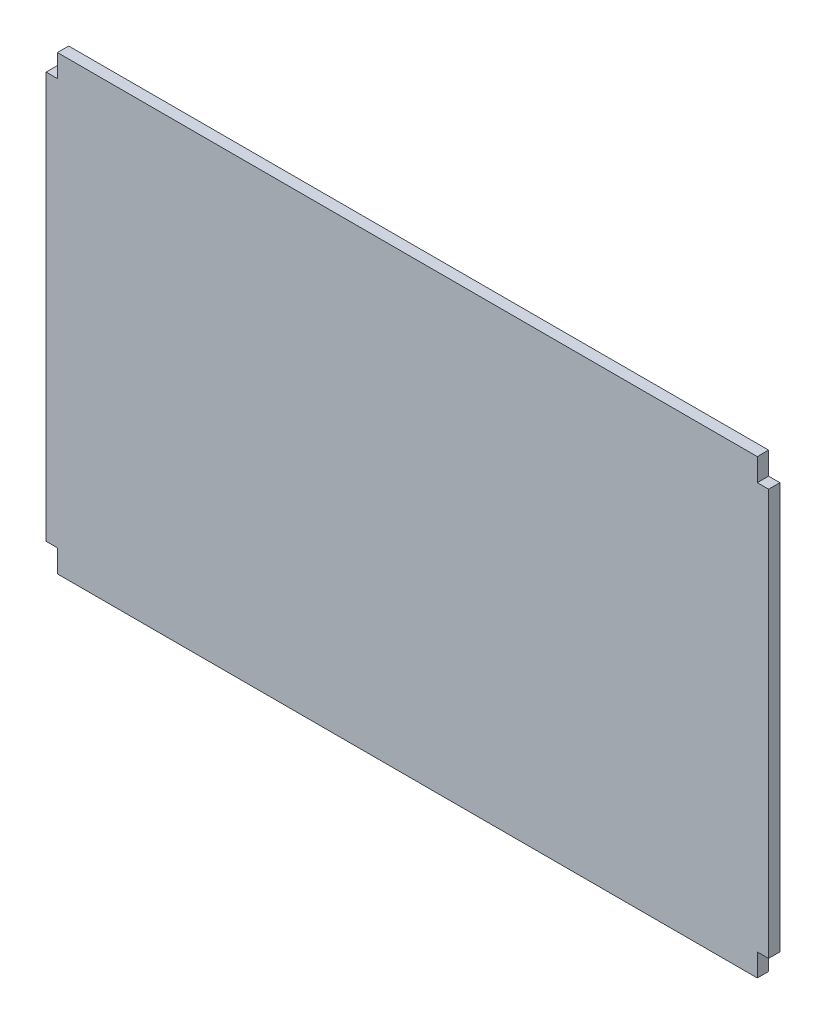
ISO-10303-21;
HEADER;
FILE_DESCRIPTION(('STEP AP214'),'2;1');
FILE_NAME('part.step','',(''),(''),'','','');
FILE_SCHEMA(('AUTOMOTIVE_DESIGN { 1 0 10303 214 1 1 1 1 }'));
ENDSEC;
DATA;
#1=APPLICATION_CONTEXT('core data for automotive mechanical design processes');
#2=APPLICATION_PROTOCOL_DEFINITION('international standard','automotive_design',2000,#1);
#3=PRODUCT_CONTEXT('',#1,'mechanical');
#4=PRODUCT('Part','Part','',(#3));
#5=PRODUCT_RELATED_PRODUCT_CATEGORY('part','',(#4));
#6=PRODUCT_DEFINITION_FORMATION('','',#4);
#7=PRODUCT_DEFINITION_CONTEXT('part definition',#1,'design');
#8=PRODUCT_DEFINITION('design','',#6,#7);
#9=PRODUCT_DEFINITION_SHAPE('','',#8);
#10=(LENGTH_UNIT() NAMED_UNIT(*) SI_UNIT(.MILLI.,.METRE.));
#11=(NAMED_UNIT(*) PLANE_ANGLE_UNIT() SI_UNIT($,.RADIAN.));
#12=(NAMED_UNIT(*) SI_UNIT($,.STERADIAN.) SOLID_ANGLE_UNIT());
#13=UNCERTAINTY_MEASURE_WITH_UNIT(LENGTH_MEASURE(1.E-05),#10,'distance_accuracy_value','');
#14=(GEOMETRIC_REPRESENTATION_CONTEXT(3) GLOBAL_UNCERTAINTY_ASSIGNED_CONTEXT((#13)) GLOBAL_UNIT_ASSIGNED_CONTEXT((#10,
#11,#12)) REPRESENTATION_CONTEXT('',''));
#15=CARTESIAN_POINT('',(0.,0.,0.));
#16=DIRECTION('',(0.,0.,1.));
#17=DIRECTION('',(1.,0.,0.));
#18=AXIS2_PLACEMENT_3D('',#15,#16,#17);
#19=CARTESIAN_POINT('',(0.,0.,3.175));
#20=DIRECTION('',(1.,0.,0.));
#21=DIRECTION('',(0.,0.,-1.));
#22=AXIS2_PLACEMENT_3D('',#19,#20,#21);
#23=PLANE('',#22);
#24=DIRECTION('',(0.,-1.,0.));
#25=VECTOR('',#24,1.);
#26=CARTESIAN_POINT('',(0.,0.,0.));
#27=LINE('',#26,#25);
#28=CARTESIAN_POINT('',(0.,6.35000000000001,0.));
#29=VERTEX_POINT('',#28);
#30=CARTESIAN_POINT('',(0.,0.,0.));
#31=VERTEX_POINT('',#30);
#32=EDGE_CURVE('E154',#29,#31,#27,.T.);
#33=ORIENTED_EDGE('',*,*,#32,.T.);
#34=DIRECTION('',(0.,0.,-1.));
#35=VECTOR('',#34,1.);
#36=CARTESIAN_POINT('',(0.,0.,3.175));
#37=LINE('',#36,#35);
#38=CARTESIAN_POINT('',(0.,0.,3.175));
#39=VERTEX_POINT('',#38);
#40=EDGE_CURVE('E11',#39,#31,#37,.T.);
#41=ORIENTED_EDGE('',*,*,#40,.F.);
#42=DIRECTION('',(0.,-1.,0.));
#43=VECTOR('',#42,1.);
#44=CARTESIAN_POINT('',(0.,0.,3.175));
#45=LINE('',#44,#43);
#46=CARTESIAN_POINT('',(0.,6.35000000000001,3.175));
#47=VERTEX_POINT('',#46);
#48=EDGE_CURVE('E176',#47,#39,#45,.T.);
#49=ORIENTED_EDGE('',*,*,#48,.F.);
#50=DIRECTION('',(0.,0.,-1.));
#51=VECTOR('',#50,1.);
#52=CARTESIAN_POINT('',(0.,6.35000000000001,3.175));
#53=LINE('',#52,#51);
#54=EDGE_CURVE('E150',#47,#29,#53,.T.);
#55=ORIENTED_EDGE('',*,*,#54,.T.);
#56=EDGE_LOOP('',(#33,#41,#49,#55));
#57=FACE_BOUND('',#56,.T.);
#58=ADVANCED_FACE('F34',(#57),#23,.F.);
#59=CARTESIAN_POINT('',(0.,0.,3.175));
#60=DIRECTION('',(0.,1.,0.));
#61=DIRECTION('',(0.,0.,1.));
#62=AXIS2_PLACEMENT_3D('',#59,#60,#61);
#63=PLANE('',#62);
#64=DIRECTION('',(1.,0.,0.));
#65=VECTOR('',#64,1.);
#66=CARTESIAN_POINT('',(0.,0.,0.));
#67=LINE('',#66,#65);
#68=CARTESIAN_POINT('',(196.85,0.,0.));
#69=VERTEX_POINT('',#68);
#70=EDGE_CURVE('E157',#31,#69,#67,.T.);
#71=ORIENTED_EDGE('',*,*,#70,.T.);
#72=DIRECTION('',(0.,0.,-1.));
#73=VECTOR('',#72,1.);
#74=CARTESIAN_POINT('',(196.85,0.,3.175));
#75=LINE('',#74,#73);
#76=CARTESIAN_POINT('',(196.85,0.,3.175));
#77=VERTEX_POINT('',#76);
#78=EDGE_CURVE('E42',#77,#69,#75,.T.);
#79=ORIENTED_EDGE('',*,*,#78,.F.);
#80=DIRECTION('',(1.,0.,0.));
#81=VECTOR('',#80,1.);
#82=CARTESIAN_POINT('',(0.,0.,3.175));
#83=LINE('',#82,#81);
#84=EDGE_CURVE('E105',#39,#77,#83,.T.);
#85=ORIENTED_EDGE('',*,*,#84,.F.);
#86=ORIENTED_EDGE('',*,*,#40,.T.);
#87=EDGE_LOOP('',(#71,#79,#85,#86));
#88=FACE_BOUND('',#87,.T.);
#89=ADVANCED_FACE('F254',(#88),#63,.F.);
#90=CARTESIAN_POINT('',(196.85,0.,3.175));
#91=DIRECTION('',(-1.,0.,0.));
#92=DIRECTION('',(0.,-1.,0.));
#93=AXIS2_PLACEMENT_3D('',#90,#91,#92);
#94=PLANE('',#93);
#95=DIRECTION('',(0.,1.,0.));
#96=VECTOR('',#95,1.);
#97=CARTESIAN_POINT('',(196.85,0.,0.));
#98=LINE('',#97,#96);
#99=CARTESIAN_POINT('',(196.85,6.35000000000001,0.));
#100=VERTEX_POINT('',#99);
#101=EDGE_CURVE('E159',#69,#100,#98,.T.);
#102=ORIENTED_EDGE('',*,*,#101,.T.);
#103=DIRECTION('',(0.,0.,-1.));
#104=VECTOR('',#103,1.);
#105=CARTESIAN_POINT('',(196.85,6.35000000000001,3.175));
#106=LINE('',#105,#104);
#107=CARTESIAN_POINT('',(196.85,6.35000000000001,3.175));
#108=VERTEX_POINT('',#107);
#109=EDGE_CURVE('E195',#108,#100,#106,.T.);
#110=ORIENTED_EDGE('',*,*,#109,.F.);
#111=DIRECTION('',(0.,1.,0.));
#112=VECTOR('',#111,1.);
#113=CARTESIAN_POINT('',(196.85,0.,3.175));
#114=LINE('',#113,#112);
#115=EDGE_CURVE('E203',#77,#108,#114,.T.);
#116=ORIENTED_EDGE('',*,*,#115,.F.);
#117=ORIENTED_EDGE('',*,*,#78,.T.);
#118=EDGE_LOOP('',(#102,#110,#116,#117));
#119=FACE_BOUND('',#118,.T.);
#120=ADVANCED_FACE('F201',(#119),#94,.F.);
#121=CARTESIAN_POINT('',(196.85,6.35000000000001,3.175));
#122=DIRECTION('',(0.,1.,0.));
#123=DIRECTION('',(0.,0.,1.));
#124=AXIS2_PLACEMENT_3D('',#121,#122,#123);
#125=PLANE('',#124);
#126=DIRECTION('',(1.,0.,0.));
#127=VECTOR('',#126,1.);
#128=CARTESIAN_POINT('',(196.85,6.35000000000001,0.));
#129=LINE('',#128,#127);
#130=CARTESIAN_POINT('',(200.025,6.35000000000001,0.));
#131=VERTEX_POINT('',#130);
#132=EDGE_CURVE('E161',#100,#131,#129,.T.);
#133=ORIENTED_EDGE('',*,*,#132,.T.);
#134=DIRECTION('',(0.,0.,-1.));
#135=VECTOR('',#134,1.);
#136=CARTESIAN_POINT('',(200.025,6.35000000000001,3.175));
#137=LINE('',#136,#135);
#138=CARTESIAN_POINT('',(200.025,6.35000000000001,3.175));
#139=VERTEX_POINT('',#138);
#140=EDGE_CURVE('E192',#139,#131,#137,.T.);
#141=ORIENTED_EDGE('',*,*,#140,.F.);
#142=DIRECTION('',(1.,0.,0.));
#143=VECTOR('',#142,1.);
#144=CARTESIAN_POINT('',(196.85,6.35000000000001,3.175));
#145=LINE('',#144,#143);
#146=EDGE_CURVE('E221',#108,#139,#145,.T.);
#147=ORIENTED_EDGE('',*,*,#146,.F.);
#148=ORIENTED_EDGE('',*,*,#109,.T.);
#149=EDGE_LOOP('',(#133,#141,#147,#148));
#150=FACE_BOUND('',#149,.T.);
#151=ADVANCED_FACE('F212',(#150),#125,.F.);
#152=CARTESIAN_POINT('',(200.025,6.35000000000001,3.175));
#153=DIRECTION('',(-1.,0.,0.));
#154=DIRECTION('',(0.,0.,1.));
#155=AXIS2_PLACEMENT_3D('',#152,#153,#154);
#156=PLANE('',#155);
#157=DIRECTION('',(0.,1.,0.));
#158=VECTOR('',#157,1.);
#159=CARTESIAN_POINT('',(200.025,6.35000000000001,0.));
#160=LINE('',#159,#158);
#161=CARTESIAN_POINT('',(200.025,120.65,0.));
#162=VERTEX_POINT('',#161);
#163=EDGE_CURVE('E163',#131,#162,#160,.T.);
#164=ORIENTED_EDGE('',*,*,#163,.T.);
#165=DIRECTION('',(0.,0.,-1.));
#166=VECTOR('',#165,1.);
#167=CARTESIAN_POINT('',(200.025,120.65,3.175));
#168=LINE('',#167,#166);
#169=CARTESIAN_POINT('',(200.025,120.65,3.175));
#170=VERTEX_POINT('',#169);
#171=EDGE_CURVE('E189',#170,#162,#168,.T.);
#172=ORIENTED_EDGE('',*,*,#171,.F.);
#173=DIRECTION('',(0.,1.,0.));
#174=VECTOR('',#173,1.);
#175=CARTESIAN_POINT('',(200.025,6.35000000000001,3.175));
#176=LINE('',#175,#174);
#177=EDGE_CURVE('E218',#139,#170,#176,.T.);
#178=ORIENTED_EDGE('',*,*,#177,.F.);
#179=ORIENTED_EDGE('',*,*,#140,.T.);
#180=EDGE_LOOP('',(#164,#172,#178,#179));
#181=FACE_BOUND('',#180,.T.);
#182=ADVANCED_FACE('F216',(#181),#156,.F.);
#183=CARTESIAN_POINT('',(196.85,120.65,3.175));
#184=DIRECTION('',(0.,-1.,0.));
#185=DIRECTION('',(0.,0.,-1.));
#186=AXIS2_PLACEMENT_3D('',#183,#184,#185);
#187=PLANE('',#186);
#188=DIRECTION('',(-1.,0.,0.));
#189=VECTOR('',#188,1.);
#190=CARTESIAN_POINT('',(196.85,120.65,0.));
#191=LINE('',#190,#189);
#192=CARTESIAN_POINT('',(196.85,120.65,0.));
#193=VERTEX_POINT('',#192);
#194=EDGE_CURVE('E165',#162,#193,#191,.T.);
#195=ORIENTED_EDGE('',*,*,#194,.T.);
#196=DIRECTION('',(0.,0.,-1.));
#197=VECTOR('',#196,1.);
#198=CARTESIAN_POINT('',(196.85,120.65,3.175));
#199=LINE('',#198,#197);
#200=CARTESIAN_POINT('',(196.85,120.65,3.175));
#201=VERTEX_POINT('',#200);
#202=EDGE_CURVE('E186',#201,#193,#199,.T.);
#203=ORIENTED_EDGE('',*,*,#202,.F.);
#204=DIRECTION('',(-1.,0.,0.));
#205=VECTOR('',#204,1.);
#206=CARTESIAN_POINT('',(196.85,120.65,3.175));
#207=LINE('',#206,#205);
#208=EDGE_CURVE('E220',#170,#201,#207,.T.);
#209=ORIENTED_EDGE('',*,*,#208,.F.);
#210=ORIENTED_EDGE('',*,*,#171,.T.);
#211=EDGE_LOOP('',(#195,#203,#209,#210));
#212=FACE_BOUND('',#211,.T.);
#213=ADVANCED_FACE('F267',(#212),#187,.F.);
#214=CARTESIAN_POINT('',(196.85,120.65,3.175));
#215=DIRECTION('',(-1.,0.,0.));
#216=DIRECTION('',(0.,-1.,0.));
#217=AXIS2_PLACEMENT_3D('',#214,#215,#216);
#218=PLANE('',#217);
#219=DIRECTION('',(0.,1.,0.));
#220=VECTOR('',#219,1.);
#221=CARTESIAN_POINT('',(196.85,120.65,0.));
#222=LINE('',#221,#220);
#223=CARTESIAN_POINT('',(196.85,127.,0.));
#224=VERTEX_POINT('',#223);
#225=EDGE_CURVE('E167',#193,#224,#222,.T.);
#226=ORIENTED_EDGE('',*,*,#225,.T.);
#227=DIRECTION('',(0.,0.,-1.));
#228=VECTOR('',#227,1.);
#229=CARTESIAN_POINT('',(196.85,127.,3.175));
#230=LINE('',#229,#228);
#231=CARTESIAN_POINT('',(196.85,127.,3.175));
#232=VERTEX_POINT('',#231);
#233=EDGE_CURVE('E183',#232,#224,#230,.T.);
#234=ORIENTED_EDGE('',*,*,#233,.F.);
#235=DIRECTION('',(0.,1.,0.));
#236=VECTOR('',#235,1.);
#237=CARTESIAN_POINT('',(196.85,120.65,3.175));
#238=LINE('',#237,#236);
#239=EDGE_CURVE('E223',#201,#232,#238,.T.);
#240=ORIENTED_EDGE('',*,*,#239,.F.);
#241=ORIENTED_EDGE('',*,*,#202,.T.);
#242=EDGE_LOOP('',(#226,#234,#240,#241));
#243=FACE_BOUND('',#242,.T.);
#244=ADVANCED_FACE('F270',(#243),#218,.F.);
#245=CARTESIAN_POINT('',(0.,127.,3.175));
#246=DIRECTION('',(0.,-1.,0.));
#247=DIRECTION('',(0.,0.,-1.));
#248=AXIS2_PLACEMENT_3D('',#245,#246,#247);
#249=PLANE('',#248);
#250=DIRECTION('',(-1.,0.,0.));
#251=VECTOR('',#250,1.);
#252=CARTESIAN_POINT('',(0.,127.,0.));
#253=LINE('',#252,#251);
#254=CARTESIAN_POINT('',(0.,127.,0.));
#255=VERTEX_POINT('',#254);
#256=EDGE_CURVE('E169',#224,#255,#253,.T.);
#257=ORIENTED_EDGE('',*,*,#256,.T.);
#258=DIRECTION('',(0.,0.,-1.));
#259=VECTOR('',#258,1.);
#260=CARTESIAN_POINT('',(0.,127.,3.175));
#261=LINE('',#260,#259);
#262=CARTESIAN_POINT('',(0.,127.,3.175));
#263=VERTEX_POINT('',#262);
#264=EDGE_CURVE('E180',#263,#255,#261,.T.);
#265=ORIENTED_EDGE('',*,*,#264,.F.);
#266=DIRECTION('',(-1.,0.,0.));
#267=VECTOR('',#266,1.);
#268=CARTESIAN_POINT('',(0.,127.,3.175));
#269=LINE('',#268,#267);
#270=EDGE_CURVE('E229',#232,#263,#269,.T.);
#271=ORIENTED_EDGE('',*,*,#270,.F.);
#272=ORIENTED_EDGE('',*,*,#233,.T.);
#273=EDGE_LOOP('',(#257,#265,#271,#272));
#274=FACE_BOUND('',#273,.T.);
#275=ADVANCED_FACE('F235',(#274),#249,.F.);
#276=CARTESIAN_POINT('',(0.,120.65,3.175));
#277=DIRECTION('',(1.,0.,0.));
#278=DIRECTION('',(0.,0.,-1.));
#279=AXIS2_PLACEMENT_3D('',#276,#277,#278);
#280=PLANE('',#279);
#281=DIRECTION('',(0.,-1.,0.));
#282=VECTOR('',#281,1.);
#283=CARTESIAN_POINT('',(0.,120.65,0.));
#284=LINE('',#283,#282);
#285=CARTESIAN_POINT('',(0.,120.65,0.));
#286=VERTEX_POINT('',#285);
#287=EDGE_CURVE('E171',#255,#286,#284,.T.);
#288=ORIENTED_EDGE('',*,*,#287,.T.);
#289=DIRECTION('',(0.,0.,-1.));
#290=VECTOR('',#289,1.);
#291=CARTESIAN_POINT('',(0.,120.65,3.175));
#292=LINE('',#291,#290);
#293=CARTESIAN_POINT('',(0.,120.65,3.175));
#294=VERTEX_POINT('',#293);
#295=EDGE_CURVE('E145',#294,#286,#292,.T.);
#296=ORIENTED_EDGE('',*,*,#295,.F.);
#297=DIRECTION('',(0.,-1.,0.));
#298=VECTOR('',#297,1.);
#299=CARTESIAN_POINT('',(0.,120.65,3.175));
#300=LINE('',#299,#298);
#301=EDGE_CURVE('E136',#263,#294,#300,.T.);
#302=ORIENTED_EDGE('',*,*,#301,.F.);
#303=ORIENTED_EDGE('',*,*,#264,.T.);
#304=EDGE_LOOP('',(#288,#296,#302,#303));
#305=FACE_BOUND('',#304,.T.);
#306=ADVANCED_FACE('F239',(#305),#280,.F.);
#307=CARTESIAN_POINT('',(0.,120.65,3.175));
#308=DIRECTION('',(0.,-1.,0.));
#309=DIRECTION('',(0.,0.,-1.));
#310=AXIS2_PLACEMENT_3D('',#307,#308,#309);
#311=PLANE('',#310);
#312=DIRECTION('',(-1.,0.,0.));
#313=VECTOR('',#312,1.);
#314=CARTESIAN_POINT('',(0.,120.65,0.));
#315=LINE('',#314,#313);
#316=CARTESIAN_POINT('',(-3.175,120.65,0.));
#317=VERTEX_POINT('',#316);
#318=EDGE_CURVE('E144',#286,#317,#315,.T.);
#319=ORIENTED_EDGE('',*,*,#318,.T.);
#320=DIRECTION('',(0.,0.,-1.));
#321=VECTOR('',#320,1.);
#322=CARTESIAN_POINT('',(-3.175,120.65,3.175));
#323=LINE('',#322,#321);
#324=CARTESIAN_POINT('',(-3.175,120.65,3.175));
#325=VERTEX_POINT('',#324);
#326=EDGE_CURVE('E141',#325,#317,#323,.T.);
#327=ORIENTED_EDGE('',*,*,#326,.F.);
#328=DIRECTION('',(-1.,0.,0.));
#329=VECTOR('',#328,1.);
#330=CARTESIAN_POINT('',(0.,120.65,3.175));
#331=LINE('',#330,#329);
#332=EDGE_CURVE('E130',#294,#325,#331,.T.);
#333=ORIENTED_EDGE('',*,*,#332,.F.);
#334=ORIENTED_EDGE('',*,*,#295,.T.);
#335=EDGE_LOOP('',(#319,#327,#333,#334));
#336=FACE_BOUND('',#335,.T.);
#337=ADVANCED_FACE('F142',(#336),#311,.F.);
#338=CARTESIAN_POINT('',(-3.175,6.35000000000001,3.175));
#339=DIRECTION('',(1.,0.,0.));
#340=DIRECTION('',(0.,1.,0.));
#341=AXIS2_PLACEMENT_3D('',#338,#339,#340);
#342=PLANE('',#341);
#343=DIRECTION('',(0.,-1.,0.));
#344=VECTOR('',#343,1.);
#345=CARTESIAN_POINT('',(-3.175,6.35000000000001,0.));
#346=LINE('',#345,#344);
#347=CARTESIAN_POINT('',(-3.175,6.35000000000001,0.));
#348=VERTEX_POINT('',#347);
#349=EDGE_CURVE('E91',#317,#348,#346,.T.);
#350=ORIENTED_EDGE('',*,*,#349,.T.);
#351=DIRECTION('',(0.,0.,-1.));
#352=VECTOR('',#351,1.);
#353=CARTESIAN_POINT('',(-3.175,6.35000000000001,3.175));
#354=LINE('',#353,#352);
#355=CARTESIAN_POINT('',(-3.175,6.35000000000001,3.175));
#356=VERTEX_POINT('',#355);
#357=EDGE_CURVE('E146',#356,#348,#354,.T.);
#358=ORIENTED_EDGE('',*,*,#357,.F.);
#359=DIRECTION('',(0.,-1.,0.));
#360=VECTOR('',#359,1.);
#361=CARTESIAN_POINT('',(-3.175,6.35000000000001,3.175));
#362=LINE('',#361,#360);
#363=EDGE_CURVE('E134',#325,#356,#362,.T.);
#364=ORIENTED_EDGE('',*,*,#363,.F.);
#365=ORIENTED_EDGE('',*,*,#326,.T.);
#366=EDGE_LOOP('',(#350,#358,#364,#365));
#367=FACE_BOUND('',#366,.T.);
#368=ADVANCED_FACE('F148',(#367),#342,.F.);
#369=CARTESIAN_POINT('',(0.,6.35000000000001,3.175));
#370=DIRECTION('',(0.,1.,0.));
#371=DIRECTION('',(0.,0.,1.));
#372=AXIS2_PLACEMENT_3D('',#369,#370,#371);
#373=PLANE('',#372);
#374=DIRECTION('',(1.,0.,0.));
#375=VECTOR('',#374,1.);
#376=CARTESIAN_POINT('',(0.,6.35000000000001,0.));
#377=LINE('',#376,#375);
#378=EDGE_CURVE('E97',#348,#29,#377,.T.);
#379=ORIENTED_EDGE('',*,*,#378,.T.);
#380=ORIENTED_EDGE('',*,*,#54,.F.);
#381=DIRECTION('',(1.,0.,0.));
#382=VECTOR('',#381,1.);
#383=CARTESIAN_POINT('',(0.,6.35000000000001,3.175));
#384=LINE('',#383,#382);
#385=EDGE_CURVE('E50',#356,#47,#384,.T.);
#386=ORIENTED_EDGE('',*,*,#385,.F.);
#387=ORIENTED_EDGE('',*,*,#357,.T.);
#388=EDGE_LOOP('',(#379,#380,#386,#387));
#389=FACE_BOUND('',#388,.T.);
#390=ADVANCED_FACE('F243',(#389),#373,.F.);
#391=CARTESIAN_POINT('',(0.,0.,3.175));
#392=DIRECTION('',(0.,0.,1.));
#393=DIRECTION('',(1.,0.,0.));
#394=AXIS2_PLACEMENT_3D('',#391,#392,#393);
#395=PLANE('',#394);
#396=ORIENTED_EDGE('',*,*,#48,.T.);
#397=ORIENTED_EDGE('',*,*,#84,.T.);
#398=ORIENTED_EDGE('',*,*,#115,.T.);
#399=ORIENTED_EDGE('',*,*,#146,.T.);
#400=ORIENTED_EDGE('',*,*,#177,.T.);
#401=ORIENTED_EDGE('',*,*,#208,.T.);
#402=ORIENTED_EDGE('',*,*,#239,.T.);
#403=ORIENTED_EDGE('',*,*,#270,.T.);
#404=ORIENTED_EDGE('',*,*,#301,.T.);
#405=ORIENTED_EDGE('',*,*,#332,.T.);
#406=ORIENTED_EDGE('',*,*,#363,.T.);
#407=ORIENTED_EDGE('',*,*,#385,.T.);
#408=EDGE_LOOP('',(#396,#397,#398,#399,#400,#401,#402,#403,#404,#405,#406,#407));
#409=FACE_BOUND('',#408,.T.);
#410=ADVANCED_FACE('F132',(#409),#395,.T.);
#411=CARTESIAN_POINT('',(0.,0.,0.));
#412=DIRECTION('',(0.,0.,1.));
#413=DIRECTION('',(1.,0.,0.));
#414=AXIS2_PLACEMENT_3D('',#411,#412,#413);
#415=PLANE('',#414);
#416=ORIENTED_EDGE('',*,*,#32,.F.);
#417=ORIENTED_EDGE('',*,*,#378,.F.);
#418=ORIENTED_EDGE('',*,*,#349,.F.);
#419=ORIENTED_EDGE('',*,*,#318,.F.);
#420=ORIENTED_EDGE('',*,*,#287,.F.);
#421=ORIENTED_EDGE('',*,*,#256,.F.);
#422=ORIENTED_EDGE('',*,*,#225,.F.);
#423=ORIENTED_EDGE('',*,*,#194,.F.);
#424=ORIENTED_EDGE('',*,*,#163,.F.);
#425=ORIENTED_EDGE('',*,*,#132,.F.);
#426=ORIENTED_EDGE('',*,*,#101,.F.);
#427=ORIENTED_EDGE('',*,*,#70,.F.);
#428=EDGE_LOOP('',(#416,#417,#418,#419,#420,#421,#422,#423,#424,#425,#426,#427));
#429=FACE_BOUND('',#428,.T.);
#430=ADVANCED_FACE('F207',(#429),#415,.F.);
#431=CLOSED_SHELL('',(#58,#89,#120,#151,#182,#213,#244,#275,#306,#337,#368,#390,#410,#430));
#432=MANIFOLD_SOLID_BREP('B2',#431);
#433=ADVANCED_BREP_SHAPE_REPRESENTATION('',(#18,#432),#14);
#434=SHAPE_DEFINITION_REPRESENTATION(#9,#433);
ENDSEC;
END-ISO-10303-21;
